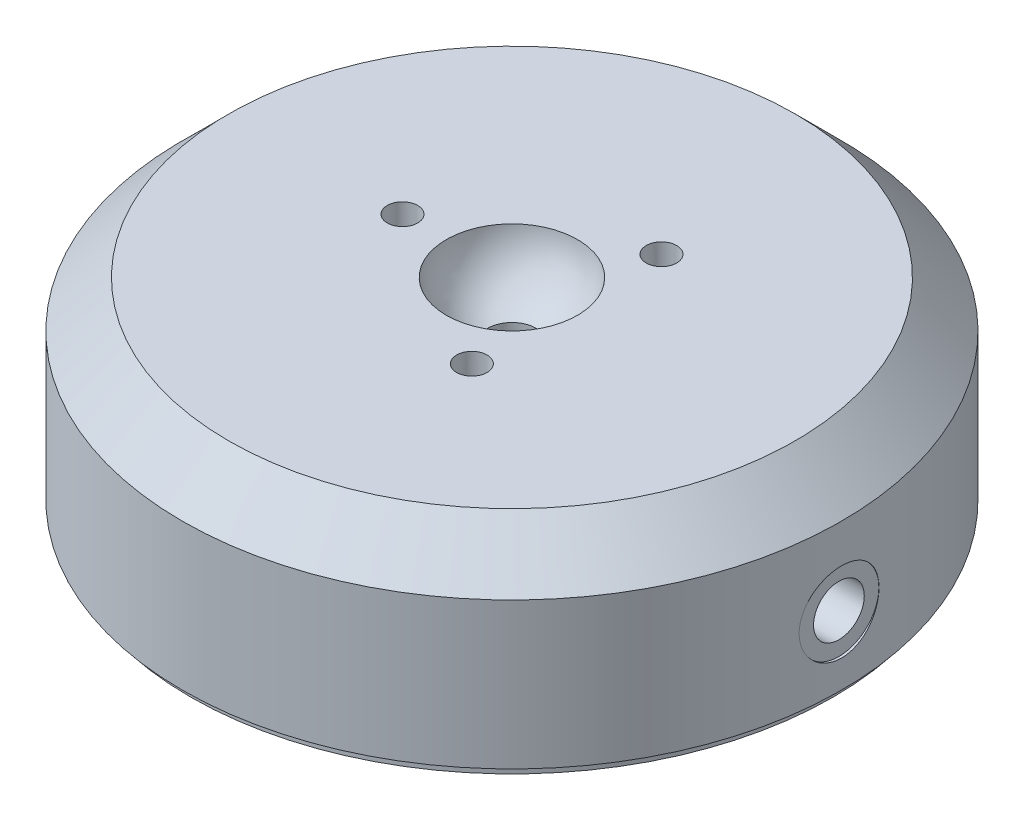
ISO-10303-21;
HEADER;
FILE_DESCRIPTION(('STEP AP214'),'2;1');
FILE_NAME('part.step','',(''),(''),'','','');
FILE_SCHEMA(('AUTOMOTIVE_DESIGN { 1 0 10303 214 1 1 1 1 }'));
ENDSEC;
DATA;
#1=APPLICATION_CONTEXT('core data for automotive mechanical design processes');
#2=APPLICATION_PROTOCOL_DEFINITION('international standard','automotive_design',2000,#1);
#3=PRODUCT_CONTEXT('',#1,'mechanical');
#4=PRODUCT('Part','Part','',(#3));
#5=PRODUCT_RELATED_PRODUCT_CATEGORY('part','',(#4));
#6=PRODUCT_DEFINITION_FORMATION('','',#4);
#7=PRODUCT_DEFINITION_CONTEXT('part definition',#1,'design');
#8=PRODUCT_DEFINITION('design','',#6,#7);
#9=PRODUCT_DEFINITION_SHAPE('','',#8);
#10=(LENGTH_UNIT() NAMED_UNIT(*) SI_UNIT(.MILLI.,.METRE.));
#11=(NAMED_UNIT(*) PLANE_ANGLE_UNIT() SI_UNIT($,.RADIAN.));
#12=(NAMED_UNIT(*) SI_UNIT($,.STERADIAN.) SOLID_ANGLE_UNIT());
#13=UNCERTAINTY_MEASURE_WITH_UNIT(LENGTH_MEASURE(1.E-05),#10,'distance_accuracy_value','');
#14=(GEOMETRIC_REPRESENTATION_CONTEXT(3) GLOBAL_UNCERTAINTY_ASSIGNED_CONTEXT((#13)) GLOBAL_UNIT_ASSIGNED_CONTEXT((#10,
#11,#12)) REPRESENTATION_CONTEXT('',''));
#15=CARTESIAN_POINT('',(0.,0.,0.));
#16=DIRECTION('',(0.,0.,1.));
#17=DIRECTION('',(1.,0.,0.));
#18=AXIS2_PLACEMENT_3D('',#15,#16,#17);
#19=CARTESIAN_POINT('',(0.,0.,0.));
#20=DIRECTION('',(0.,1.,0.));
#21=DIRECTION('',(0.,0.,1.));
#22=AXIS2_PLACEMENT_3D('',#19,#20,#21);
#23=PLANE('',#22);
#24=CARTESIAN_POINT('',(0.,0.,0.));
#25=DIRECTION('',(0.,1.,0.));
#26=DIRECTION('',(0.,0.,1.));
#27=AXIS2_PLACEMENT_3D('',#24,#25,#26);
#28=CIRCLE('',#27,32.5);
#29=CARTESIAN_POINT('',(0.,0.,32.5));
#30=VERTEX_POINT('',#29);
#31=EDGE_CURVE('E130',#30,#30,#28,.T.);
#32=ORIENTED_EDGE('',*,*,#31,.F.);
#33=EDGE_LOOP('',(#32));
#34=FACE_BOUND('',#33,.T.);
#35=CARTESIAN_POINT('',(0.,0.,0.));
#36=DIRECTION('',(0.,1.,0.));
#37=DIRECTION('',(0.,0.,1.));
#38=AXIS2_PLACEMENT_3D('',#35,#36,#37);
#39=CIRCLE('',#38,31.6865);
#40=CARTESIAN_POINT('',(0.,0.,31.6865));
#41=VERTEX_POINT('',#40);
#42=EDGE_CURVE('E11',#41,#41,#39,.F.);
#43=ORIENTED_EDGE('',*,*,#42,.F.);
#44=EDGE_LOOP('',(#43));
#45=FACE_BOUND('',#44,.T.);
#46=ADVANCED_FACE('F40',(#34,#45),#23,.F.);
#47=CARTESIAN_POINT('',(0.,18.9992,0.));
#48=DIRECTION('',(0.,1.,0.));
#49=DIRECTION('',(0.,0.,1.));
#50=AXIS2_PLACEMENT_3D('',#47,#48,#49);
#51=PLANE('',#50);
#52=CARTESIAN_POINT('',(5.39750000000004,18.9992,-9.34874423385299));
#53=DIRECTION('',(0.,1.,0.));
#54=DIRECTION('',(0.,0.,1.));
#55=AXIS2_PLACEMENT_3D('',#52,#53,#54);
#56=CIRCLE('',#55,1.49999999999999);
#57=CARTESIAN_POINT('',(5.39750000000004,18.9992,-7.848744233853));
#58=VERTEX_POINT('',#57);
#59=EDGE_CURVE('E94',#58,#58,#56,.T.);
#60=ORIENTED_EDGE('',*,*,#59,.F.);
#61=EDGE_LOOP('',(#60));
#62=FACE_BOUND('',#61,.T.);
#63=CARTESIAN_POINT('',(-10.795,18.9992,0.));
#64=DIRECTION('',(0.,1.,0.));
#65=DIRECTION('',(0.,0.,1.));
#66=AXIS2_PLACEMENT_3D('',#63,#64,#65);
#67=CIRCLE('',#66,1.49999999999999);
#68=CARTESIAN_POINT('',(-10.795,18.9992,1.49999999999999));
#69=VERTEX_POINT('',#68);
#70=EDGE_CURVE('E106',#69,#69,#67,.T.);
#71=ORIENTED_EDGE('',*,*,#70,.F.);
#72=EDGE_LOOP('',(#71));
#73=FACE_BOUND('',#72,.T.);
#74=CARTESIAN_POINT('',(5.39749999999991,18.9992,9.34874423385306));
#75=DIRECTION('',(0.,1.,0.));
#76=DIRECTION('',(0.,0.,1.));
#77=AXIS2_PLACEMENT_3D('',#74,#75,#76);
#78=CIRCLE('',#77,1.49999999999999);
#79=CARTESIAN_POINT('',(5.39749999999991,18.9992,10.8487442338531));
#80=VERTEX_POINT('',#79);
#81=EDGE_CURVE('E118',#80,#80,#78,.T.);
#82=ORIENTED_EDGE('',*,*,#81,.F.);
#83=EDGE_LOOP('',(#82));
#84=FACE_BOUND('',#83,.T.);
#85=CARTESIAN_POINT('',(0.,18.9992,0.));
#86=DIRECTION('',(0.,1.,0.));
#87=DIRECTION('',(0.,0.,1.));
#88=AXIS2_PLACEMENT_3D('',#85,#86,#87);
#89=CIRCLE('',#88,27.93);
#90=CARTESIAN_POINT('',(0.,18.9992,27.93));
#91=VERTEX_POINT('',#90);
#92=EDGE_CURVE('E133',#91,#91,#89,.T.);
#93=ORIENTED_EDGE('',*,*,#92,.T.);
#94=EDGE_LOOP('',(#93));
#95=FACE_BOUND('',#94,.T.);
#96=CARTESIAN_POINT('',(0.,18.9992,0.));
#97=DIRECTION('',(0.,1.,0.));
#98=DIRECTION('',(0.,0.,1.));
#99=AXIS2_PLACEMENT_3D('',#96,#97,#98);
#100=CIRCLE('',#99,6.47052587808179);
#101=CARTESIAN_POINT('',(0.,18.9992,6.47052587808179));
#102=VERTEX_POINT('',#101);
#103=EDGE_CURVE('E124',#102,#102,#100,.T.);
#104=ORIENTED_EDGE('',*,*,#103,.F.);
#105=EDGE_LOOP('',(#104));
#106=FACE_BOUND('',#105,.T.);
#107=ADVANCED_FACE('F224',(#62,#73,#84,#95,#106),#51,.T.);
#108=CARTESIAN_POINT('',(0.,18.9992,0.));
#109=DIRECTION('',(0.,-1.,0.));
#110=DIRECTION('',(0.,0.,-1.));
#111=AXIS2_PLACEMENT_3D('',#108,#109,#110);
#112=CYLINDRICAL_SURFACE('',#111,32.5);
#113=CARTESIAN_POINT('',(32.2606576343385,6.6802,-3.937));
#114=CARTESIAN_POINT('',(32.2606607117609,6.45992920358478,-3.93699060270578));
#115=CARTESIAN_POINT('',(32.2629379465772,6.23951938799948,-3.91845178107488));
#116=CARTESIAN_POINT('',(32.2717977639591,5.80482989090819,-3.84478766246212));
#117=CARTESIAN_POINT('',(32.2783848868334,5.59055692309112,-3.78962378142121));
#118=CARTESIAN_POINT('',(32.2951076676596,5.1744978807938,-3.6443562668019));
#119=CARTESIAN_POINT('',(32.3052409602318,4.97270358805682,-3.55427591903813));
#120=CARTESIAN_POINT('',(32.3279114569405,4.58713495948316,-3.34178155200302));
#121=CARTESIAN_POINT('',(32.3404482388428,4.40335746709338,-3.21937321054515));
#122=CARTESIAN_POINT('',(32.3665870596922,4.05803301401996,-2.94500695083202));
#123=CARTESIAN_POINT('',(32.3801938281947,3.89659459103919,-2.79291286001561));
#124=CARTESIAN_POINT('',(32.4068968907658,3.60146800867114,-2.46378536276874));
#125=CARTESIAN_POINT('',(32.4199931597661,3.46778121064501,-2.28675073359028));
#126=CARTESIAN_POINT('',(32.444247798807,3.23156545083443,-1.91208778073501));
#127=CARTESIAN_POINT('',(32.4554000326374,3.12913440851188,-1.71439729021297));
#128=CARTESIAN_POINT('',(32.4744581387239,2.95896484550703,-1.30446306765547));
#129=CARTESIAN_POINT('',(32.4823641244517,2.8912251121796,-1.09221984460925));
#130=CARTESIAN_POINT('',(32.4940056496503,2.79268448832878,-0.660313276956973));
#131=CARTESIAN_POINT('',(32.4977615241881,2.76170342888848,-0.440691595225157));
#132=CARTESIAN_POINT('',(32.5007490388185,2.73700137170403,0.00066365081032843));
#133=CARTESIAN_POINT('',(32.499980846673,2.74327899232995,0.222397136499461));
#134=CARTESIAN_POINT('',(32.4940232665938,2.79277139489333,0.660456442486981));
#135=CARTESIAN_POINT('',(32.4888570713447,2.83579241592629,0.876804513833656));
#136=CARTESIAN_POINT('',(32.4747101003817,2.95724769645997,1.29918729024892));
#137=CARTESIAN_POINT('',(32.4657292559032,3.03568259434875,1.50522180932593));
#138=CARTESIAN_POINT('',(32.4449222252536,3.22594627618692,1.9017306074414));
#139=CARTESIAN_POINT('',(32.4330888821475,3.33785922971177,2.09216410712474));
#140=CARTESIAN_POINT('',(32.4079014198268,3.59184101695612,2.45162029388692));
#141=CARTESIAN_POINT('',(32.3945472351082,3.73391114979925,2.62064205808099));
#142=CARTESIAN_POINT('',(32.3677121014172,4.04526043545003,2.93361462892956));
#143=CARTESIAN_POINT('',(32.3542308890072,4.21470840179428,3.07739752725264));
#144=CARTESIAN_POINT('',(32.3287458773731,4.57542253414505,3.33450676726805));
#145=CARTESIAN_POINT('',(32.3167420822871,4.76668876125957,3.44783302365525));
#146=CARTESIAN_POINT('',(32.2955709836531,5.16575620727235,3.64081990247828));
#147=CARTESIAN_POINT('',(32.2864047699154,5.37356374065237,3.72046759450571));
#148=CARTESIAN_POINT('',(32.2719681661801,5.79973953686677,3.84369025200798));
#149=CARTESIAN_POINT('',(32.2666976002251,6.01810732224421,3.8872668467417));
#150=CARTESIAN_POINT('',(32.2606809652752,6.45772351212313,3.93688904062043));
#151=CARTESIAN_POINT('',(32.2599064387264,6.67894489622777,3.94317070276453));
#152=CARTESIAN_POINT('',(32.2628943463057,7.11928731510798,3.91864708670252));
#153=CARTESIAN_POINT('',(32.2666566897537,7.33840839177497,3.88784254975262));
#154=CARTESIAN_POINT('',(32.2782684645102,7.76762599672657,3.79021951316157));
#155=CARTESIAN_POINT('',(32.2861049724871,7.97774879981406,3.72351486597742));
#156=CARTESIAN_POINT('',(32.3049716268879,8.38382633797431,3.55610214267029));
#157=CARTESIAN_POINT('',(32.3160018790334,8.57978060376188,3.45539294088653));
#158=CARTESIAN_POINT('',(32.3400814876806,8.95302801588984,3.2222476230208));
#159=CARTESIAN_POINT('',(32.3531405994578,9.13022365409932,3.08965642789899));
#160=CARTESIAN_POINT('',(32.3797756593591,9.45993000586326,2.7967306351772));
#161=CARTESIAN_POINT('',(32.3933516263277,9.61243981831391,2.63639502526791));
#162=CARTESIAN_POINT('',(32.4195779010596,9.88927201555865,2.29150171786291));
#163=CARTESIAN_POINT('',(32.4322228765256,10.0134394706976,2.10681920127842));
#164=CARTESIAN_POINT('',(32.4550830567593,10.2289912805986,1.71908314174179));
#165=CARTESIAN_POINT('',(32.4652983079355,10.3203762615356,1.51602994977896));
#166=CARTESIAN_POINT('',(32.4821243277566,10.4675120673059,1.09783566528183));
#167=CARTESIAN_POINT('',(32.4887442156969,10.5233531084747,0.882726696152372));
#168=CARTESIAN_POINT('',(32.4976714251825,10.5981095664873,0.446100664981551));
#169=CARTESIAN_POINT('',(32.499978928778,10.6170265421069,0.224583873851641));
#170=CARTESIAN_POINT('',(32.5000206500595,10.6173699842955,-0.217055496822939));
#171=CARTESIAN_POINT('',(32.4977840420224,10.5990356133366,-0.437177926069299));
#172=CARTESIAN_POINT('',(32.4890467474189,10.5259024961349,-0.871188974524772));
#173=CARTESIAN_POINT('',(32.4825460625923,10.4711037647711,-1.08507759627752));
#174=CARTESIAN_POINT('',(32.4660079572623,10.3266711277657,-1.50052305164835));
#175=CARTESIAN_POINT('',(32.4559716256788,10.2370479465966,-1.70208365968219));
#176=CARTESIAN_POINT('',(32.4334747980136,10.0255352697157,-2.08734147462536));
#177=CARTESIAN_POINT('',(32.4210142802437,9.90364548532497,-2.27103852169501));
#178=CARTESIAN_POINT('',(32.3949653198367,9.63017233521503,-2.61657748747723));
#179=CARTESIAN_POINT('',(32.3813704097558,9.47841090647172,-2.77827799993794));
#180=CARTESIAN_POINT('',(32.3546373255929,9.14987040181662,-3.07401236552118));
#181=CARTESIAN_POINT('',(32.3414992606666,8.97308539739923,-3.20803964383527));
#182=CARTESIAN_POINT('',(32.3171165417056,8.59878390943384,-3.44503506211267));
#183=CARTESIAN_POINT('',(32.3058789362956,8.40119447638868,-3.54788865229333));
#184=CARTESIAN_POINT('',(32.2866522523592,7.99152504661828,-3.71881035646415));
#185=CARTESIAN_POINT('',(32.2786596204416,7.77946119900892,-3.78691654151393));
#186=CARTESIAN_POINT('',(32.2687812629459,7.41860130962524,-3.86998956251351));
#187=CARTESIAN_POINT('',(32.2657499429299,7.27208709347249,-3.89508264755828));
#188=CARTESIAN_POINT('',(32.2616870982292,6.97713630421098,-3.9285909759856));
#189=CARTESIAN_POINT('',(32.2606555596356,6.82869974447967,-3.93700633536453));
#190=CARTESIAN_POINT('',(32.2606576343385,6.6802,-3.937));
#191=B_SPLINE_CURVE_WITH_KNOTS('',3,(#113,#114,#115,#116,#117,#118,#119,#120,#121,#122,#123,
#124,#125,#126,#127,#128,#129,#130,#131,#132,#133,#134,#135,#136,#137,#138,#139,#140,#141,#142,
#143,#144,#145,#146,#147,#148,#149,#150,#151,#152,#153,#154,#155,#156,#157,#158,#159,#160,#161,
#162,#163,#164,#165,#166,#167,#168,#169,#170,#171,#172,#173,#174,#175,#176,#177,#178,#179,#180,
#181,#182,#183,#184,#185,#186,#187,#188,#189,#190),.UNSPECIFIED.,.T.,.F.,(4,2,2,2,2,2,2,2,2,2,2,
2,2,2,2,2,2,2,2,2,2,2,2,2,2,2,2,2,2,2,2,2,2,2,2,2,2,2,4),(0.,0.660269929873976,1.32123655222946,
1.98176313181842,2.64217377920422,3.30568820665074,3.96923517523353,4.63484008202965,
5.30042172081798,5.96272742180945,6.62500856327124,7.28381867481123,7.94264066286241,
8.60313316627395,9.26365412843504,9.92841530335916,10.5931783401741,11.2581963721206,
11.9231843649017,12.5839587062328,13.2447198406307,13.9033977011592,14.5620973681942,
15.2240682833092,15.8860633568241,16.551594813563,17.2171135573719,17.8809362981821,
18.5447310146343,19.2042774795878,19.8638236754172,20.5231669194023,21.1825160625202,
21.8459215516686,22.5094844766148,23.1754569438407,23.8406981615914,24.2858347817441,
24.7309683058862),.UNSPECIFIED.);
#192=CARTESIAN_POINT('',(32.2606576343385,6.6802,-3.937));
#193=VERTEX_POINT('',#192);
#194=EDGE_CURVE('E48',#193,#193,#191,.T.);
#195=ORIENTED_EDGE('',*,*,#194,.T.);
#196=EDGE_LOOP('',(#195));
#197=FACE_BOUND('',#196,.T.);
#198=CARTESIAN_POINT('',(0.,14.4292,0.));
#199=DIRECTION('',(0.,1.,0.));
#200=DIRECTION('',(0.,0.,1.));
#201=AXIS2_PLACEMENT_3D('',#198,#199,#200);
#202=CIRCLE('',#201,32.5);
#203=CARTESIAN_POINT('',(0.,14.4292,32.5));
#204=VERTEX_POINT('',#203);
#205=EDGE_CURVE('E136',#204,#204,#202,.F.);
#206=ORIENTED_EDGE('',*,*,#205,.T.);
#207=EDGE_LOOP('',(#206));
#208=FACE_BOUND('',#207,.T.);
#209=ORIENTED_EDGE('',*,*,#31,.T.);
#210=EDGE_LOOP('',(#209));
#211=FACE_BOUND('',#210,.T.);
#212=ADVANCED_FACE('F142',(#197,#208,#211),#112,.T.);
#213=CARTESIAN_POINT('',(0.,18.9992,0.));
#214=DIRECTION('',(0.,1.,0.));
#215=DIRECTION('',(0.,0.,1.));
#216=AXIS2_PLACEMENT_3D('',#213,#214,#215);
#217=CYLINDRICAL_SURFACE('',#216,2.3876);
#218=CARTESIAN_POINT('',(0.,12.7508,0.));
#219=DIRECTION('',(0.,1.,0.));
#220=DIRECTION('',(0.,0.,1.));
#221=AXIS2_PLACEMENT_3D('',#218,#219,#220);
#222=CIRCLE('',#221,2.3876);
#223=CARTESIAN_POINT('',(0.,12.7508,2.3876));
#224=VERTEX_POINT('',#223);
#225=EDGE_CURVE('E121',#224,#224,#222,.T.);
#226=ORIENTED_EDGE('',*,*,#225,.F.);
#227=EDGE_LOOP('',(#226));
#228=FACE_BOUND('',#227,.T.);
#229=CARTESIAN_POINT('',(0.,13.4637634279824,0.));
#230=DIRECTION('',(0.,1.,0.));
#231=DIRECTION('',(0.,0.,1.));
#232=AXIS2_PLACEMENT_3D('',#229,#230,#231);
#233=CIRCLE('',#232,2.3876);
#234=CARTESIAN_POINT('',(0.,13.4637634279824,2.3876));
#235=VERTEX_POINT('',#234);
#236=EDGE_CURVE('E127',#235,#235,#233,.T.);
#237=ORIENTED_EDGE('',*,*,#236,.T.);
#238=EDGE_LOOP('',(#237));
#239=FACE_BOUND('',#238,.T.);
#240=ADVANCED_FACE('F219',(#228,#239),#217,.F.);
#241=CARTESIAN_POINT('',(0.,19.5072,0.));
#242=DIRECTION('',(0.,1.,0.));
#243=DIRECTION('',(0.,0.,1.));
#244=AXIS2_PLACEMENT_3D('',#241,#242,#243);
#245=DEGENERATE_TOROIDAL_SURFACE('',#244,0.0119999999999981,6.5024,.F.);
#246=ORIENTED_EDGE('',*,*,#103,.T.);
#247=EDGE_LOOP('',(#246));
#248=FACE_BOUND('',#247,.T.);
#249=ORIENTED_EDGE('',*,*,#236,.F.);
#250=EDGE_LOOP('',(#249));
#251=FACE_BOUND('',#250,.T.);
#252=ADVANCED_FACE('F215',(#248,#251),#245,.T.);
#253=CARTESIAN_POINT('',(1.7408725538381,12.7508,0.));
#254=DIRECTION('',(0.,-1.,0.));
#255=DIRECTION('',(0.,0.,-1.));
#256=AXIS2_PLACEMENT_3D('',#253,#254,#255);
#257=PLANE('',#256);
#258=ORIENTED_EDGE('',*,*,#225,.T.);
#259=EDGE_LOOP('',(#258));
#260=FACE_BOUND('',#259,.T.);
#261=ADVANCED_FACE('F212',(#260),#257,.F.);
#262=CARTESIAN_POINT('',(0.,18.9992,0.));
#263=DIRECTION('',(0.,-1.,0.));
#264=DIRECTION('',(0.,0.,-1.));
#265=AXIS2_PLACEMENT_3D('',#262,#263,#264);
#266=CONICAL_SURFACE('',#265,27.93,0.785398163397448);
#267=ORIENTED_EDGE('',*,*,#205,.F.);
#268=EDGE_LOOP('',(#267));
#269=FACE_BOUND('',#268,.T.);
#270=ORIENTED_EDGE('',*,*,#92,.F.);
#271=EDGE_LOOP('',(#270));
#272=FACE_BOUND('',#271,.T.);
#273=ADVANCED_FACE('F42',(#269,#272),#266,.T.);
#274=CARTESIAN_POINT('',(5.39749999999991,18.9992,9.34874423385306));
#275=DIRECTION('',(0.,1.,0.));
#276=DIRECTION('',(0.,0.,1.));
#277=AXIS2_PLACEMENT_3D('',#274,#275,#276);
#278=CYLINDRICAL_SURFACE('',#277,1.49999999999999);
#279=CARTESIAN_POINT('',(5.39749999999991,12.6492,9.34874423385306));
#280=DIRECTION('',(0.,1.,0.));
#281=DIRECTION('',(0.,0.,1.));
#282=AXIS2_PLACEMENT_3D('',#279,#280,#281);
#283=CIRCLE('',#282,1.49999999999999);
#284=CARTESIAN_POINT('',(5.39749999999991,12.6492,10.8487442338531));
#285=VERTEX_POINT('',#284);
#286=EDGE_CURVE('E115',#285,#285,#283,.T.);
#287=ORIENTED_EDGE('',*,*,#286,.F.);
#288=EDGE_LOOP('',(#287));
#289=FACE_BOUND('',#288,.T.);
#290=ORIENTED_EDGE('',*,*,#81,.T.);
#291=EDGE_LOOP('',(#290));
#292=FACE_BOUND('',#291,.T.);
#293=ADVANCED_FACE('F207',(#289,#292),#278,.F.);
#294=CARTESIAN_POINT('',(6.64749999999991,12.6492,9.34874423385306));
#295=DIRECTION('',(0.,-1.,0.));
#296=DIRECTION('',(0.,0.,-1.));
#297=AXIS2_PLACEMENT_3D('',#294,#295,#296);
#298=PLANE('',#297);
#299=CARTESIAN_POINT('',(5.39749999999991,12.6492,9.34874423385306));
#300=DIRECTION('',(0.,1.,0.));
#301=DIRECTION('',(0.,0.,1.));
#302=AXIS2_PLACEMENT_3D('',#299,#300,#301);
#303=CIRCLE('',#302,1.25);
#304=CARTESIAN_POINT('',(5.39749999999991,12.6492,10.5987442338531));
#305=VERTEX_POINT('',#304);
#306=EDGE_CURVE('E112',#305,#305,#303,.T.);
#307=ORIENTED_EDGE('',*,*,#306,.F.);
#308=EDGE_LOOP('',(#307));
#309=FACE_BOUND('',#308,.T.);
#310=ORIENTED_EDGE('',*,*,#286,.T.);
#311=EDGE_LOOP('',(#310));
#312=FACE_BOUND('',#311,.T.);
#313=ADVANCED_FACE('F203',(#309,#312),#298,.F.);
#314=CARTESIAN_POINT('',(5.39749999999991,18.9992,9.34874423385306));
#315=DIRECTION('',(0.,1.,0.));
#316=DIRECTION('',(0.,0.,1.));
#317=AXIS2_PLACEMENT_3D('',#314,#315,#316);
#318=CYLINDRICAL_SURFACE('',#317,1.25);
#319=CARTESIAN_POINT('',(5.39749999999991,11.1506,9.34874423385306));
#320=DIRECTION('',(0.,1.,0.));
#321=DIRECTION('',(0.,0.,1.));
#322=AXIS2_PLACEMENT_3D('',#319,#320,#321);
#323=CIRCLE('',#322,1.25);
#324=CARTESIAN_POINT('',(5.39749999999991,11.1506,10.5987442338531));
#325=VERTEX_POINT('',#324);
#326=EDGE_CURVE('E109',#325,#325,#323,.T.);
#327=ORIENTED_EDGE('',*,*,#326,.F.);
#328=EDGE_LOOP('',(#327));
#329=FACE_BOUND('',#328,.T.);
#330=ORIENTED_EDGE('',*,*,#306,.T.);
#331=EDGE_LOOP('',(#330));
#332=FACE_BOUND('',#331,.T.);
#333=ADVANCED_FACE('F200',(#329,#332),#318,.F.);
#334=CARTESIAN_POINT('',(5.39749999999991,11.1506,9.34874423385306));
#335=DIRECTION('',(0.,1.,0.));
#336=DIRECTION('',(0.,0.,1.));
#337=AXIS2_PLACEMENT_3D('',#334,#335,#336);
#338=CONICAL_SURFACE('',#337,1.25,1.02974425867665);
#339=CARTESIAN_POINT('',(5.39749999999991,10.3995242262156,9.34874423385306));
#340=VERTEX_POINT('',#339);
#341=VERTEX_LOOP('',#340);
#342=FACE_BOUND('',#341,.T.);
#343=ORIENTED_EDGE('',*,*,#326,.T.);
#344=EDGE_LOOP('',(#343));
#345=FACE_BOUND('',#344,.T.);
#346=ADVANCED_FACE('F196',(#342,#345),#338,.F.);
#347=CARTESIAN_POINT('',(-10.795,18.9992,0.));
#348=DIRECTION('',(0.,1.,0.));
#349=DIRECTION('',(0.,0.,1.));
#350=AXIS2_PLACEMENT_3D('',#347,#348,#349);
#351=CYLINDRICAL_SURFACE('',#350,1.49999999999999);
#352=CARTESIAN_POINT('',(-10.795,12.6492,0.));
#353=DIRECTION('',(0.,1.,0.));
#354=DIRECTION('',(0.,0.,1.));
#355=AXIS2_PLACEMENT_3D('',#352,#353,#354);
#356=CIRCLE('',#355,1.49999999999999);
#357=CARTESIAN_POINT('',(-10.795,12.6492,1.49999999999999));
#358=VERTEX_POINT('',#357);
#359=EDGE_CURVE('E103',#358,#358,#356,.T.);
#360=ORIENTED_EDGE('',*,*,#359,.F.);
#361=EDGE_LOOP('',(#360));
#362=FACE_BOUND('',#361,.T.);
#363=ORIENTED_EDGE('',*,*,#70,.T.);
#364=EDGE_LOOP('',(#363));
#365=FACE_BOUND('',#364,.T.);
#366=ADVANCED_FACE('F192',(#362,#365),#351,.F.);
#367=CARTESIAN_POINT('',(-9.545,12.6492,0.));
#368=DIRECTION('',(0.,-1.,0.));
#369=DIRECTION('',(0.,0.,-1.));
#370=AXIS2_PLACEMENT_3D('',#367,#368,#369);
#371=PLANE('',#370);
#372=CARTESIAN_POINT('',(-10.795,12.6492,0.));
#373=DIRECTION('',(0.,1.,0.));
#374=DIRECTION('',(0.,0.,1.));
#375=AXIS2_PLACEMENT_3D('',#372,#373,#374);
#376=CIRCLE('',#375,1.25);
#377=CARTESIAN_POINT('',(-10.795,12.6492,1.25));
#378=VERTEX_POINT('',#377);
#379=EDGE_CURVE('E100',#378,#378,#376,.T.);
#380=ORIENTED_EDGE('',*,*,#379,.F.);
#381=EDGE_LOOP('',(#380));
#382=FACE_BOUND('',#381,.T.);
#383=ORIENTED_EDGE('',*,*,#359,.T.);
#384=EDGE_LOOP('',(#383));
#385=FACE_BOUND('',#384,.T.);
#386=ADVANCED_FACE('F188',(#382,#385),#371,.F.);
#387=CARTESIAN_POINT('',(-10.795,18.9992,0.));
#388=DIRECTION('',(0.,1.,0.));
#389=DIRECTION('',(0.,0.,1.));
#390=AXIS2_PLACEMENT_3D('',#387,#388,#389);
#391=CYLINDRICAL_SURFACE('',#390,1.25);
#392=CARTESIAN_POINT('',(-10.795,11.1506,0.));
#393=DIRECTION('',(0.,1.,0.));
#394=DIRECTION('',(0.,0.,1.));
#395=AXIS2_PLACEMENT_3D('',#392,#393,#394);
#396=CIRCLE('',#395,1.25);
#397=CARTESIAN_POINT('',(-10.795,11.1506,1.25));
#398=VERTEX_POINT('',#397);
#399=EDGE_CURVE('E97',#398,#398,#396,.T.);
#400=ORIENTED_EDGE('',*,*,#399,.F.);
#401=EDGE_LOOP('',(#400));
#402=FACE_BOUND('',#401,.T.);
#403=ORIENTED_EDGE('',*,*,#379,.T.);
#404=EDGE_LOOP('',(#403));
#405=FACE_BOUND('',#404,.T.);
#406=ADVANCED_FACE('F185',(#402,#405),#391,.F.);
#407=CARTESIAN_POINT('',(-10.795,11.1506,0.));
#408=DIRECTION('',(0.,1.,0.));
#409=DIRECTION('',(0.,0.,1.));
#410=AXIS2_PLACEMENT_3D('',#407,#408,#409);
#411=CONICAL_SURFACE('',#410,1.25,1.02974425867665);
#412=CARTESIAN_POINT('',(-10.795,10.3995242262156,0.));
#413=VERTEX_POINT('',#412);
#414=VERTEX_LOOP('',#413);
#415=FACE_BOUND('',#414,.T.);
#416=ORIENTED_EDGE('',*,*,#399,.T.);
#417=EDGE_LOOP('',(#416));
#418=FACE_BOUND('',#417,.T.);
#419=ADVANCED_FACE('F181',(#415,#418),#411,.F.);
#420=CARTESIAN_POINT('',(5.39750000000004,18.9992,-9.34874423385299));
#421=DIRECTION('',(0.,1.,0.));
#422=DIRECTION('',(0.,0.,1.));
#423=AXIS2_PLACEMENT_3D('',#420,#421,#422);
#424=CYLINDRICAL_SURFACE('',#423,1.49999999999999);
#425=CARTESIAN_POINT('',(5.39750000000004,12.6492,-9.34874423385299));
#426=DIRECTION('',(0.,1.,0.));
#427=DIRECTION('',(0.,0.,1.));
#428=AXIS2_PLACEMENT_3D('',#425,#426,#427);
#429=CIRCLE('',#428,1.49999999999999);
#430=CARTESIAN_POINT('',(5.39750000000004,12.6492,-7.848744233853));
#431=VERTEX_POINT('',#430);
#432=EDGE_CURVE('E91',#431,#431,#429,.T.);
#433=ORIENTED_EDGE('',*,*,#432,.F.);
#434=EDGE_LOOP('',(#433));
#435=FACE_BOUND('',#434,.T.);
#436=ORIENTED_EDGE('',*,*,#59,.T.);
#437=EDGE_LOOP('',(#436));
#438=FACE_BOUND('',#437,.T.);
#439=ADVANCED_FACE('F177',(#435,#438),#424,.F.);
#440=CARTESIAN_POINT('',(6.64750000000004,12.6492,-9.34874423385299));
#441=DIRECTION('',(0.,-1.,0.));
#442=DIRECTION('',(0.,0.,-1.));
#443=AXIS2_PLACEMENT_3D('',#440,#441,#442);
#444=PLANE('',#443);
#445=CARTESIAN_POINT('',(5.39750000000004,12.6492,-9.34874423385299));
#446=DIRECTION('',(0.,1.,0.));
#447=DIRECTION('',(0.,0.,1.));
#448=AXIS2_PLACEMENT_3D('',#445,#446,#447);
#449=CIRCLE('',#448,1.25);
#450=CARTESIAN_POINT('',(5.39750000000004,12.6492,-8.09874423385299));
#451=VERTEX_POINT('',#450);
#452=EDGE_CURVE('E88',#451,#451,#449,.T.);
#453=ORIENTED_EDGE('',*,*,#452,.F.);
#454=EDGE_LOOP('',(#453));
#455=FACE_BOUND('',#454,.T.);
#456=ORIENTED_EDGE('',*,*,#432,.T.);
#457=EDGE_LOOP('',(#456));
#458=FACE_BOUND('',#457,.T.);
#459=ADVANCED_FACE('F173',(#455,#458),#444,.F.);
#460=CARTESIAN_POINT('',(5.39750000000004,18.9992,-9.34874423385299));
#461=DIRECTION('',(0.,1.,0.));
#462=DIRECTION('',(0.,0.,1.));
#463=AXIS2_PLACEMENT_3D('',#460,#461,#462);
#464=CYLINDRICAL_SURFACE('',#463,1.25);
#465=CARTESIAN_POINT('',(5.39750000000004,11.1506,-9.34874423385299));
#466=DIRECTION('',(0.,1.,0.));
#467=DIRECTION('',(0.,0.,1.));
#468=AXIS2_PLACEMENT_3D('',#465,#466,#467);
#469=CIRCLE('',#468,1.25);
#470=CARTESIAN_POINT('',(5.39750000000004,11.1506,-8.09874423385299));
#471=VERTEX_POINT('',#470);
#472=EDGE_CURVE('E85',#471,#471,#469,.T.);
#473=ORIENTED_EDGE('',*,*,#472,.F.);
#474=EDGE_LOOP('',(#473));
#475=FACE_BOUND('',#474,.T.);
#476=ORIENTED_EDGE('',*,*,#452,.T.);
#477=EDGE_LOOP('',(#476));
#478=FACE_BOUND('',#477,.T.);
#479=ADVANCED_FACE('F169',(#475,#478),#464,.F.);
#480=CARTESIAN_POINT('',(5.39750000000004,11.1506,-9.34874423385299));
#481=DIRECTION('',(0.,1.,0.));
#482=DIRECTION('',(0.,0.,1.));
#483=AXIS2_PLACEMENT_3D('',#480,#481,#482);
#484=CONICAL_SURFACE('',#483,1.25,1.02974425867665);
#485=CARTESIAN_POINT('',(5.39750000000004,10.3995242262156,-9.34874423385299));
#486=VERTEX_POINT('',#485);
#487=VERTEX_LOOP('',#486);
#488=FACE_BOUND('',#487,.T.);
#489=ORIENTED_EDGE('',*,*,#472,.T.);
#490=EDGE_LOOP('',(#489));
#491=FACE_BOUND('',#490,.T.);
#492=ADVANCED_FACE('F150',(#488,#491),#484,.F.);
#493=CARTESIAN_POINT('',(32.5,6.6802,0.));
#494=DIRECTION('',(1.,0.,0.));
#495=DIRECTION('',(0.,0.,-1.));
#496=AXIS2_PLACEMENT_3D('',#493,#494,#495);
#497=CYLINDRICAL_SURFACE('',#496,3.937);
#498=CARTESIAN_POINT('',(32.246,6.6802,0.));
#499=DIRECTION('',(1.,0.,0.));
#500=DIRECTION('',(0.,0.,-1.));
#501=AXIS2_PLACEMENT_3D('',#498,#499,#500);
#502=CIRCLE('',#501,3.937);
#503=CARTESIAN_POINT('',(32.246,6.6802,-3.937));
#504=VERTEX_POINT('',#503);
#505=EDGE_CURVE('E78',#504,#504,#502,.T.);
#506=ORIENTED_EDGE('',*,*,#505,.F.);
#507=EDGE_LOOP('',(#506));
#508=FACE_BOUND('',#507,.T.);
#509=ORIENTED_EDGE('',*,*,#194,.F.);
#510=EDGE_LOOP('',(#509));
#511=FACE_BOUND('',#510,.T.);
#512=ADVANCED_FACE('F145',(#508,#511),#497,.F.);
#513=CARTESIAN_POINT('',(32.246,8.20420000000001,0.));
#514=DIRECTION('',(-1.,0.,0.));
#515=DIRECTION('',(0.,0.,1.));
#516=AXIS2_PLACEMENT_3D('',#513,#514,#515);
#517=PLANE('',#516);
#518=ORIENTED_EDGE('',*,*,#505,.T.);
#519=EDGE_LOOP('',(#518));
#520=FACE_BOUND('',#519,.T.);
#521=CARTESIAN_POINT('',(32.246,6.6802,0.));
#522=DIRECTION('',(-1.,0.,0.));
#523=DIRECTION('',(0.,0.,1.));
#524=AXIS2_PLACEMENT_3D('',#521,#522,#523);
#525=CIRCLE('',#524,2.5);
#526=CARTESIAN_POINT('',(32.246,6.6802,2.5));
#527=VERTEX_POINT('',#526);
#528=EDGE_CURVE('E72',#527,#527,#525,.F.);
#529=ORIENTED_EDGE('',*,*,#528,.F.);
#530=EDGE_LOOP('',(#529));
#531=FACE_BOUND('',#530,.T.);
#532=ADVANCED_FACE('F65',(#520,#531),#517,.F.);
#533=CARTESIAN_POINT('',(4.56,6.6802,0.));
#534=DIRECTION('',(1.,0.,0.));
#535=DIRECTION('',(0.,0.,-1.));
#536=AXIS2_PLACEMENT_3D('',#533,#534,#535);
#537=CONICAL_SURFACE('',#536,2.09999999999999,1.02974425867665);
#538=CARTESIAN_POINT('',(3.29819270004212,6.68019999999999,0.));
#539=VERTEX_POINT('',#538);
#540=VERTEX_LOOP('',#539);
#541=FACE_BOUND('',#540,.T.);
#542=CARTESIAN_POINT('',(4.56,6.6802,0.));
#543=DIRECTION('',(1.,0.,0.));
#544=DIRECTION('',(0.,0.,-1.));
#545=AXIS2_PLACEMENT_3D('',#542,#543,#544);
#546=CIRCLE('',#545,2.09999999999999);
#547=CARTESIAN_POINT('',(4.56,6.6802,-2.09999999999999));
#548=VERTEX_POINT('',#547);
#549=EDGE_CURVE('E69',#548,#548,#546,.T.);
#550=ORIENTED_EDGE('',*,*,#549,.T.);
#551=EDGE_LOOP('',(#550));
#552=FACE_BOUND('',#551,.T.);
#553=ADVANCED_FACE('F61',(#541,#552),#537,.F.);
#554=CARTESIAN_POINT('',(32.5,6.6802,0.));
#555=DIRECTION('',(1.,0.,0.));
#556=DIRECTION('',(0.,0.,-1.));
#557=AXIS2_PLACEMENT_3D('',#554,#555,#556);
#558=CYLINDRICAL_SURFACE('',#557,2.09999999999999);
#559=ORIENTED_EDGE('',*,*,#549,.F.);
#560=EDGE_LOOP('',(#559));
#561=FACE_BOUND('',#560,.T.);
#562=CARTESIAN_POINT('',(24.88,6.6802,0.));
#563=DIRECTION('',(1.,0.,0.));
#564=DIRECTION('',(0.,0.,-1.));
#565=AXIS2_PLACEMENT_3D('',#562,#563,#564);
#566=CIRCLE('',#565,2.09999999999999);
#567=CARTESIAN_POINT('',(24.88,6.6802,-2.09999999999999));
#568=VERTEX_POINT('',#567);
#569=EDGE_CURVE('E71',#568,#568,#566,.T.);
#570=ORIENTED_EDGE('',*,*,#569,.T.);
#571=EDGE_LOOP('',(#570));
#572=FACE_BOUND('',#571,.T.);
#573=ADVANCED_FACE('F64',(#561,#572),#558,.F.);
#574=CARTESIAN_POINT('',(24.88,8.7802,0.));
#575=DIRECTION('',(-1.,0.,0.));
#576=DIRECTION('',(0.,0.,1.));
#577=AXIS2_PLACEMENT_3D('',#574,#575,#576);
#578=PLANE('',#577);
#579=ORIENTED_EDGE('',*,*,#569,.F.);
#580=EDGE_LOOP('',(#579));
#581=FACE_BOUND('',#580,.T.);
#582=CARTESIAN_POINT('',(24.88,6.6802,0.));
#583=DIRECTION('',(1.,0.,0.));
#584=DIRECTION('',(0.,0.,-1.));
#585=AXIS2_PLACEMENT_3D('',#582,#583,#584);
#586=CIRCLE('',#585,2.5);
#587=CARTESIAN_POINT('',(24.88,6.6802,-2.49999999999999));
#588=VERTEX_POINT('',#587);
#589=EDGE_CURVE('E75',#588,#588,#586,.T.);
#590=ORIENTED_EDGE('',*,*,#589,.T.);
#591=EDGE_LOOP('',(#590));
#592=FACE_BOUND('',#591,.T.);
#593=ADVANCED_FACE('F159',(#581,#592),#578,.F.);
#594=CARTESIAN_POINT('',(32.5,6.6802,0.));
#595=DIRECTION('',(1.,0.,0.));
#596=DIRECTION('',(0.,0.,-1.));
#597=AXIS2_PLACEMENT_3D('',#594,#595,#596);
#598=CYLINDRICAL_SURFACE('',#597,2.5);
#599=ORIENTED_EDGE('',*,*,#528,.T.);
#600=EDGE_LOOP('',(#599));
#601=FACE_BOUND('',#600,.T.);
#602=ORIENTED_EDGE('',*,*,#589,.F.);
#603=EDGE_LOOP('',(#602));
#604=FACE_BOUND('',#603,.T.);
#605=ADVANCED_FACE('F162',(#601,#604),#598,.F.);
#606=CARTESIAN_POINT('',(0.,-1.00076,0.));
#607=DIRECTION('',(0.,1.,0.));
#608=DIRECTION('',(0.,0.,1.));
#609=AXIS2_PLACEMENT_3D('',#606,#607,#608);
#610=CYLINDRICAL_SURFACE('',#609,31.6865);
#611=CARTESIAN_POINT('',(0.,-1.00076,0.));
#612=DIRECTION('',(0.,-1.,0.));
#613=DIRECTION('',(0.,0.,-1.));
#614=AXIS2_PLACEMENT_3D('',#611,#612,#613);
#615=CIRCLE('',#614,31.6865);
#616=CARTESIAN_POINT('',(0.,-1.00076,-31.6865));
#617=VERTEX_POINT('',#616);
#618=EDGE_CURVE('E244',#617,#617,#615,.T.);
#619=ORIENTED_EDGE('',*,*,#618,.F.);
#620=EDGE_LOOP('',(#619));
#621=FACE_BOUND('',#620,.T.);
#622=ORIENTED_EDGE('',*,*,#42,.T.);
#623=EDGE_LOOP('',(#622));
#624=FACE_BOUND('',#623,.T.);
#625=ADVANCED_FACE('F152',(#621,#624),#610,.T.);
#626=CARTESIAN_POINT('',(0.,-1.00076,0.));
#627=DIRECTION('',(0.,-1.,0.));
#628=DIRECTION('',(0.,0.,-1.));
#629=AXIS2_PLACEMENT_3D('',#626,#627,#628);
#630=PLANE('',#629);
#631=ORIENTED_EDGE('',*,*,#618,.T.);
#632=EDGE_LOOP('',(#631));
#633=FACE_BOUND('',#632,.T.);
#634=ADVANCED_FACE('F236',(#633),#630,.T.);
#635=CLOSED_SHELL('',(#46,#107,#212,#240,#252,#261,#273,#293,#313,#333,#346,#366,#386,#406,#419,
#439,#459,#479,#492,#512,#532,#553,#573,#593,#605,#625,#634));
#636=MANIFOLD_SOLID_BREP('B2',#635);
#637=ADVANCED_BREP_SHAPE_REPRESENTATION('',(#18,#636),#14);
#638=SHAPE_DEFINITION_REPRESENTATION(#9,#637);
ENDSEC;
END-ISO-10303-21;
